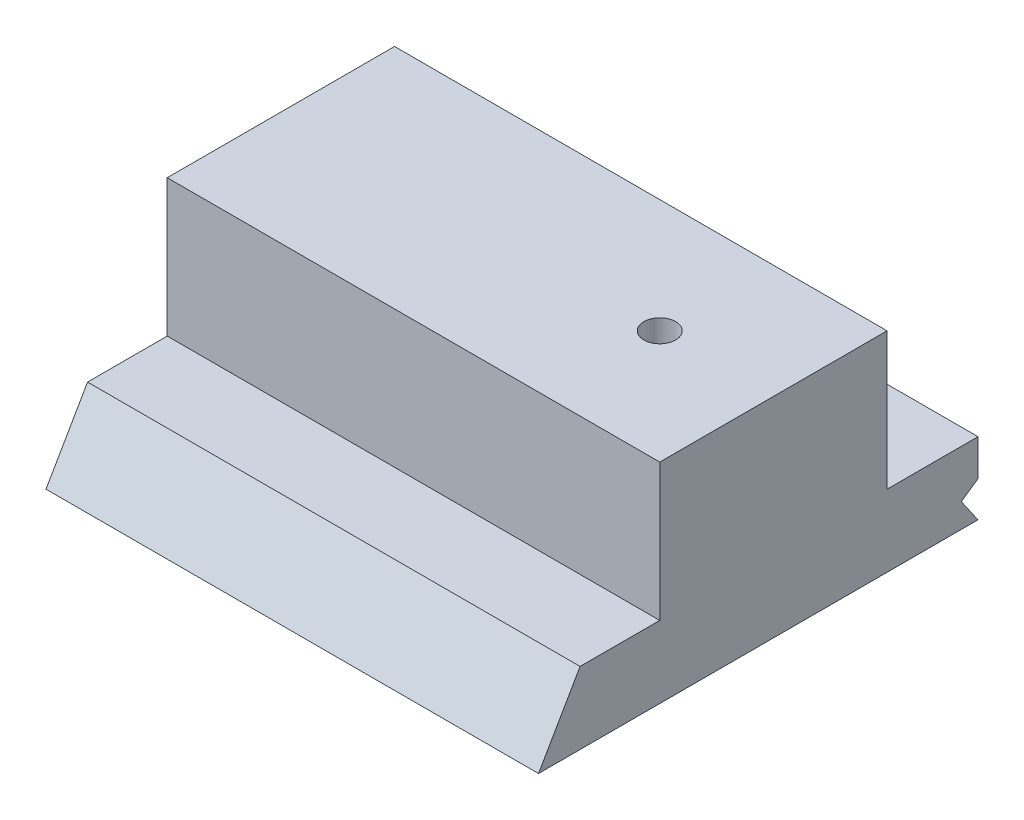
ISO-10303-21;
HEADER;
FILE_DESCRIPTION(('STEP AP214'),'2;1');
FILE_NAME('part.step','',(''),(''),'','','');
FILE_SCHEMA(('AUTOMOTIVE_DESIGN { 1 0 10303 214 1 1 1 1 }'));
ENDSEC;
DATA;
#1=APPLICATION_CONTEXT('core data for automotive mechanical design processes');
#2=APPLICATION_PROTOCOL_DEFINITION('international standard','automotive_design',2000,#1);
#3=PRODUCT_CONTEXT('',#1,'mechanical');
#4=PRODUCT('Part','Part','',(#3));
#5=PRODUCT_RELATED_PRODUCT_CATEGORY('part','',(#4));
#6=PRODUCT_DEFINITION_FORMATION('','',#4);
#7=PRODUCT_DEFINITION_CONTEXT('part definition',#1,'design');
#8=PRODUCT_DEFINITION('design','',#6,#7);
#9=PRODUCT_DEFINITION_SHAPE('','',#8);
#10=(LENGTH_UNIT() NAMED_UNIT(*) SI_UNIT(.MILLI.,.METRE.));
#11=(NAMED_UNIT(*) PLANE_ANGLE_UNIT() SI_UNIT($,.RADIAN.));
#12=(NAMED_UNIT(*) SI_UNIT($,.STERADIAN.) SOLID_ANGLE_UNIT());
#13=UNCERTAINTY_MEASURE_WITH_UNIT(LENGTH_MEASURE(1.E-05),#10,'distance_accuracy_value','');
#14=(GEOMETRIC_REPRESENTATION_CONTEXT(3) GLOBAL_UNCERTAINTY_ASSIGNED_CONTEXT((#13)) GLOBAL_UNIT_ASSIGNED_CONTEXT((#10,
#11,#12)) REPRESENTATION_CONTEXT('',''));
#15=CARTESIAN_POINT('',(0.,0.,0.));
#16=DIRECTION('',(0.,0.,1.));
#17=DIRECTION('',(1.,0.,0.));
#18=AXIS2_PLACEMENT_3D('',#15,#16,#17);
#19=CARTESIAN_POINT('',(50.,0.,-31.));
#20=DIRECTION('',(0.,1.,0.));
#21=DIRECTION('',(0.,0.,1.));
#22=AXIS2_PLACEMENT_3D('',#19,#20,#21);
#23=CYLINDRICAL_SURFACE('',#22,2.1);
#24=CARTESIAN_POINT('',(50.,27.6,-31.));
#25=DIRECTION('',(0.,1.,0.));
#26=DIRECTION('',(0.,0.,1.));
#27=AXIS2_PLACEMENT_3D('',#24,#25,#26);
#28=CIRCLE('',#27,2.1);
#29=CARTESIAN_POINT('',(50.,27.6,-28.9));
#30=VERTEX_POINT('',#29);
#31=EDGE_CURVE('E140',#30,#30,#28,.T.);
#32=ORIENTED_EDGE('',*,*,#31,.T.);
#33=EDGE_LOOP('',(#32));
#34=FACE_BOUND('',#33,.T.);
#35=CARTESIAN_POINT('',(50.,20.,-31.));
#36=DIRECTION('',(0.,-1.,0.));
#37=DIRECTION('',(0.,0.,-1.));
#38=AXIS2_PLACEMENT_3D('',#35,#36,#37);
#39=CIRCLE('',#38,2.1);
#40=CARTESIAN_POINT('',(50.,20.,-33.1));
#41=VERTEX_POINT('',#40);
#42=EDGE_CURVE('E40',#41,#41,#39,.F.);
#43=ORIENTED_EDGE('',*,*,#42,.F.);
#44=EDGE_LOOP('',(#43));
#45=FACE_BOUND('',#44,.T.);
#46=ADVANCED_FACE('F36',(#34,#45),#23,.F.);
#47=CARTESIAN_POINT('',(0.,9.5,-58.));
#48=DIRECTION('',(0.,-1.,0.));
#49=DIRECTION('',(0.,0.,-1.));
#50=AXIS2_PLACEMENT_3D('',#47,#48,#49);
#51=PLANE('',#50);
#52=DIRECTION('',(-1.,0.,0.));
#53=VECTOR('',#52,1.);
#54=CARTESIAN_POINT('',(100.037265875065,9.5,-46.));
#55=LINE('',#54,#53);
#56=CARTESIAN_POINT('',(65.,9.5,-46.));
#57=VERTEX_POINT('',#56);
#58=CARTESIAN_POINT('',(0.,9.5,-46.));
#59=VERTEX_POINT('',#58);
#60=EDGE_CURVE('E53',#57,#59,#55,.T.);
#61=ORIENTED_EDGE('',*,*,#60,.F.);
#62=DIRECTION('',(0.,0.,-1.));
#63=VECTOR('',#62,1.);
#64=CARTESIAN_POINT('',(65.,9.5,0.));
#65=LINE('',#64,#63);
#66=CARTESIAN_POINT('',(65.,9.5,-58.));
#67=VERTEX_POINT('',#66);
#68=EDGE_CURVE('E122',#57,#67,#65,.T.);
#69=ORIENTED_EDGE('',*,*,#68,.T.);
#70=DIRECTION('',(-1.,0.,0.));
#71=VECTOR('',#70,1.);
#72=CARTESIAN_POINT('',(0.,9.5,-58.));
#73=LINE('',#72,#71);
#74=CARTESIAN_POINT('',(0.,9.5,-58.));
#75=VERTEX_POINT('',#74);
#76=EDGE_CURVE('E117',#67,#75,#73,.T.);
#77=ORIENTED_EDGE('',*,*,#76,.T.);
#78=DIRECTION('',(0.,0.,1.));
#79=VECTOR('',#78,1.);
#80=CARTESIAN_POINT('',(0.,9.5,0.));
#81=LINE('',#80,#79);
#82=EDGE_CURVE('E114',#75,#59,#81,.T.);
#83=ORIENTED_EDGE('',*,*,#82,.T.);
#84=EDGE_LOOP('',(#61,#69,#77,#83));
#85=FACE_BOUND('',#84,.T.);
#86=ADVANCED_FACE('F115',(#85),#51,.F.);
#87=CARTESIAN_POINT('',(0.,9.5,0.));
#88=DIRECTION('',(1.,0.,0.));
#89=DIRECTION('',(0.,0.,-1.));
#90=AXIS2_PLACEMENT_3D('',#87,#88,#89);
#91=PLANE('',#90);
#92=DIRECTION('',(0.,-0.56940887936098,0.822054455680931));
#93=VECTOR('',#92,1.);
#94=CARTESIAN_POINT('',(0.,3.17613558209291,-55.8));
#95=LINE('',#94,#93);
#96=CARTESIAN_POINT('',(0.,4.7,-58.));
#97=VERTEX_POINT('',#96);
#98=CARTESIAN_POINT('',(0.,3.17613558209291,-55.8));
#99=VERTEX_POINT('',#98);
#100=EDGE_CURVE('E170',#97,#99,#95,.T.);
#101=ORIENTED_EDGE('',*,*,#100,.T.);
#102=DIRECTION('',(0.,-0.822054455680934,-0.569408879360977));
#103=VECTOR('',#102,1.);
#104=CARTESIAN_POINT('',(0.,0.,-58.));
#105=LINE('',#104,#103);
#106=CARTESIAN_POINT('',(0.,0.,-58.));
#107=VERTEX_POINT('',#106);
#108=EDGE_CURVE('E167',#99,#107,#105,.T.);
#109=ORIENTED_EDGE('',*,*,#108,.T.);
#110=DIRECTION('',(0.,0.,1.));
#111=VECTOR('',#110,1.);
#112=CARTESIAN_POINT('',(0.,0.,0.));
#113=LINE('',#112,#111);
#114=CARTESIAN_POINT('',(0.,0.,0.));
#115=VERTEX_POINT('',#114);
#116=EDGE_CURVE('E187',#107,#115,#113,.T.);
#117=ORIENTED_EDGE('',*,*,#116,.T.);
#118=DIRECTION('',(0.,0.86602540378444,-0.499999999999998));
#119=VECTOR('',#118,1.);
#120=CARTESIAN_POINT('',(0.,0.,0.));
#121=LINE('',#120,#119);
#122=CARTESIAN_POINT('',(0.,9.5,-5.48482755730141));
#123=VERTEX_POINT('',#122);
#124=EDGE_CURVE('E181',#115,#123,#121,.T.);
#125=ORIENTED_EDGE('',*,*,#124,.T.);
#126=CARTESIAN_POINT('',(0.,9.5,-16.));
#127=VERTEX_POINT('',#126);
#128=EDGE_CURVE('E123',#127,#123,#81,.T.);
#129=ORIENTED_EDGE('',*,*,#128,.F.);
#130=DIRECTION('',(0.,1.,0.));
#131=VECTOR('',#130,1.);
#132=CARTESIAN_POINT('',(0.,9.5,-16.));
#133=LINE('',#132,#131);
#134=CARTESIAN_POINT('',(0.,27.6,-16.));
#135=VERTEX_POINT('',#134);
#136=EDGE_CURVE('E139',#127,#135,#133,.T.);
#137=ORIENTED_EDGE('',*,*,#136,.T.);
#138=DIRECTION('',(0.,0.,-1.));
#139=VECTOR('',#138,1.);
#140=CARTESIAN_POINT('',(0.,27.6,-46.));
#141=LINE('',#140,#139);
#142=CARTESIAN_POINT('',(0.,27.6,-46.));
#143=VERTEX_POINT('',#142);
#144=EDGE_CURVE('E134',#135,#143,#141,.T.);
#145=ORIENTED_EDGE('',*,*,#144,.T.);
#146=DIRECTION('',(0.,-1.,0.));
#147=VECTOR('',#146,1.);
#148=CARTESIAN_POINT('',(0.,9.5,-46.));
#149=LINE('',#148,#147);
#150=EDGE_CURVE('E130',#143,#59,#149,.T.);
#151=ORIENTED_EDGE('',*,*,#150,.T.);
#152=ORIENTED_EDGE('',*,*,#82,.F.);
#153=DIRECTION('',(0.,-1.,0.));
#154=VECTOR('',#153,1.);
#155=CARTESIAN_POINT('',(0.,9.5,-58.));
#156=LINE('',#155,#154);
#157=EDGE_CURVE('E45',#75,#97,#156,.T.);
#158=ORIENTED_EDGE('',*,*,#157,.T.);
#159=EDGE_LOOP('',(#101,#109,#117,#125,#129,#137,#145,#151,#152,#158));
#160=FACE_BOUND('',#159,.T.);
#161=ADVANCED_FACE('F38',(#160),#91,.F.);
#162=CARTESIAN_POINT('',(65.,9.5,0.));
#163=DIRECTION('',(-1.,0.,0.));
#164=DIRECTION('',(0.,0.,1.));
#165=AXIS2_PLACEMENT_3D('',#162,#163,#164);
#166=PLANE('',#165);
#167=DIRECTION('',(0.,0.,-1.));
#168=VECTOR('',#167,1.);
#169=CARTESIAN_POINT('',(65.,0.,0.));
#170=LINE('',#169,#168);
#171=CARTESIAN_POINT('',(65.,0.,0.));
#172=VERTEX_POINT('',#171);
#173=CARTESIAN_POINT('',(65.,0.,-58.));
#174=VERTEX_POINT('',#173);
#175=EDGE_CURVE('E199',#172,#174,#170,.T.);
#176=ORIENTED_EDGE('',*,*,#175,.T.);
#177=DIRECTION('',(0.,-0.822054455680934,-0.569408879360977));
#178=VECTOR('',#177,1.);
#179=CARTESIAN_POINT('',(65.,0.,-58.));
#180=LINE('',#179,#178);
#181=CARTESIAN_POINT('',(65.,3.17613558209291,-55.8));
#182=VERTEX_POINT('',#181);
#183=EDGE_CURVE('E151',#182,#174,#180,.T.);
#184=ORIENTED_EDGE('',*,*,#183,.F.);
#185=DIRECTION('',(0.,-0.56940887936098,0.822054455680931));
#186=VECTOR('',#185,1.);
#187=CARTESIAN_POINT('',(65.,3.17613558209291,-55.8));
#188=LINE('',#187,#186);
#189=CARTESIAN_POINT('',(65.,4.7,-58.));
#190=VERTEX_POINT('',#189);
#191=EDGE_CURVE('E171',#190,#182,#188,.T.);
#192=ORIENTED_EDGE('',*,*,#191,.F.);
#193=DIRECTION('',(0.,-1.,0.));
#194=VECTOR('',#193,1.);
#195=CARTESIAN_POINT('',(65.,9.5,-58.));
#196=LINE('',#195,#194);
#197=EDGE_CURVE('E11',#67,#190,#196,.T.);
#198=ORIENTED_EDGE('',*,*,#197,.F.);
#199=ORIENTED_EDGE('',*,*,#68,.F.);
#200=DIRECTION('',(0.,1.,0.));
#201=VECTOR('',#200,1.);
#202=CARTESIAN_POINT('',(65.,9.5,-46.));
#203=LINE('',#202,#201);
#204=CARTESIAN_POINT('',(65.,27.6,-46.));
#205=VERTEX_POINT('',#204);
#206=EDGE_CURVE('E132',#57,#205,#203,.T.);
#207=ORIENTED_EDGE('',*,*,#206,.T.);
#208=DIRECTION('',(0.,0.,1.));
#209=VECTOR('',#208,1.);
#210=CARTESIAN_POINT('',(65.,27.6,-46.));
#211=LINE('',#210,#209);
#212=CARTESIAN_POINT('',(65.,27.6,-16.));
#213=VERTEX_POINT('',#212);
#214=EDGE_CURVE('E152',#205,#213,#211,.T.);
#215=ORIENTED_EDGE('',*,*,#214,.T.);
#216=DIRECTION('',(0.,-1.,0.));
#217=VECTOR('',#216,1.);
#218=CARTESIAN_POINT('',(65.,9.5,-16.));
#219=LINE('',#218,#217);
#220=CARTESIAN_POINT('',(65.,9.5,-16.));
#221=VERTEX_POINT('',#220);
#222=EDGE_CURVE('E155',#213,#221,#219,.T.);
#223=ORIENTED_EDGE('',*,*,#222,.T.);
#224=CARTESIAN_POINT('',(65.,9.5,-5.48482755730141));
#225=VERTEX_POINT('',#224);
#226=EDGE_CURVE('E61',#225,#221,#65,.T.);
#227=ORIENTED_EDGE('',*,*,#226,.F.);
#228=DIRECTION('',(0.,0.86602540378444,-0.499999999999998));
#229=VECTOR('',#228,1.);
#230=CARTESIAN_POINT('',(65.,0.,0.));
#231=LINE('',#230,#229);
#232=EDGE_CURVE('E179',#172,#225,#231,.T.);
#233=ORIENTED_EDGE('',*,*,#232,.F.);
#234=EDGE_LOOP('',(#176,#184,#192,#198,#199,#207,#215,#223,#227,#233));
#235=FACE_BOUND('',#234,.T.);
#236=ADVANCED_FACE('F208',(#235),#166,.F.);
#237=CARTESIAN_POINT('',(0.,9.5,-58.));
#238=DIRECTION('',(0.,0.,1.));
#239=DIRECTION('',(1.,0.,0.));
#240=AXIS2_PLACEMENT_3D('',#237,#238,#239);
#241=PLANE('',#240);
#242=ORIENTED_EDGE('',*,*,#197,.T.);
#243=DIRECTION('',(1.,0.,0.));
#244=VECTOR('',#243,1.);
#245=CARTESIAN_POINT('',(0.,4.7,-58.));
#246=LINE('',#245,#244);
#247=EDGE_CURVE('E173',#97,#190,#246,.T.);
#248=ORIENTED_EDGE('',*,*,#247,.F.);
#249=ORIENTED_EDGE('',*,*,#157,.F.);
#250=ORIENTED_EDGE('',*,*,#76,.F.);
#251=EDGE_LOOP('',(#242,#248,#249,#250));
#252=FACE_BOUND('',#251,.T.);
#253=ADVANCED_FACE('F212',(#252),#241,.F.);
#254=ORIENTED_EDGE('',*,*,#226,.T.);
#255=DIRECTION('',(-1.,0.,0.));
#256=VECTOR('',#255,1.);
#257=CARTESIAN_POINT('',(100.037265875065,9.5,-16.));
#258=LINE('',#257,#256);
#259=EDGE_CURVE('E133',#221,#127,#258,.T.);
#260=ORIENTED_EDGE('',*,*,#259,.T.);
#261=ORIENTED_EDGE('',*,*,#128,.T.);
#262=DIRECTION('',(1.,0.,0.));
#263=VECTOR('',#262,1.);
#264=CARTESIAN_POINT('',(0.,9.5,-5.48482755730141));
#265=LINE('',#264,#263);
#266=EDGE_CURVE('E184',#123,#225,#265,.T.);
#267=ORIENTED_EDGE('',*,*,#266,.T.);
#268=EDGE_LOOP('',(#254,#260,#261,#267));
#269=FACE_BOUND('',#268,.T.);
#270=ADVANCED_FACE('F230',(#269),#51,.F.);
#271=CARTESIAN_POINT('',(0.,0.,-58.));
#272=DIRECTION('',(0.,-1.,0.));
#273=DIRECTION('',(0.,0.,-1.));
#274=AXIS2_PLACEMENT_3D('',#271,#272,#273);
#275=PLANE('',#274);
#276=CARTESIAN_POINT('',(50.,0.,-31.));
#277=DIRECTION('',(0.,-1.,0.));
#278=DIRECTION('',(0.,0.,-1.));
#279=AXIS2_PLACEMENT_3D('',#276,#277,#278);
#280=CIRCLE('',#279,4.00000000000001);
#281=CARTESIAN_POINT('',(50.,0.,-35.));
#282=VERTEX_POINT('',#281);
#283=EDGE_CURVE('E242',#282,#282,#280,.T.);
#284=ORIENTED_EDGE('',*,*,#283,.F.);
#285=EDGE_LOOP('',(#284));
#286=FACE_BOUND('',#285,.T.);
#287=ORIENTED_EDGE('',*,*,#116,.F.);
#288=DIRECTION('',(-1.,0.,0.));
#289=VECTOR('',#288,1.);
#290=CARTESIAN_POINT('',(0.,0.,-58.));
#291=LINE('',#290,#289);
#292=EDGE_CURVE('E197',#174,#107,#291,.T.);
#293=ORIENTED_EDGE('',*,*,#292,.F.);
#294=ORIENTED_EDGE('',*,*,#175,.F.);
#295=DIRECTION('',(1.,0.,0.));
#296=VECTOR('',#295,1.);
#297=CARTESIAN_POINT('',(0.,0.,0.));
#298=LINE('',#297,#296);
#299=EDGE_CURVE('E202',#115,#172,#298,.T.);
#300=ORIENTED_EDGE('',*,*,#299,.F.);
#301=EDGE_LOOP('',(#287,#293,#294,#300));
#302=FACE_BOUND('',#301,.T.);
#303=ADVANCED_FACE('F222',(#286,#302),#275,.T.);
#304=CARTESIAN_POINT('',(0.,0.,0.));
#305=DIRECTION('',(0.,-0.499999999999998,-0.86602540378444));
#306=DIRECTION('',(0.,0.86602540378444,-0.499999999999998));
#307=AXIS2_PLACEMENT_3D('',#304,#305,#306);
#308=PLANE('',#307);
#309=ORIENTED_EDGE('',*,*,#232,.T.);
#310=ORIENTED_EDGE('',*,*,#266,.F.);
#311=ORIENTED_EDGE('',*,*,#124,.F.);
#312=ORIENTED_EDGE('',*,*,#299,.T.);
#313=EDGE_LOOP('',(#309,#310,#311,#312));
#314=FACE_BOUND('',#313,.T.);
#315=ADVANCED_FACE('F228',(#314),#308,.F.);
#316=CARTESIAN_POINT('',(0.,0.,-58.));
#317=DIRECTION('',(0.,-0.569408879360977,0.822054455680933));
#318=DIRECTION('',(0.,-0.822054455680934,-0.569408879360977));
#319=AXIS2_PLACEMENT_3D('',#316,#317,#318);
#320=PLANE('',#319);
#321=ORIENTED_EDGE('',*,*,#183,.T.);
#322=ORIENTED_EDGE('',*,*,#292,.T.);
#323=ORIENTED_EDGE('',*,*,#108,.F.);
#324=DIRECTION('',(1.,0.,0.));
#325=VECTOR('',#324,1.);
#326=CARTESIAN_POINT('',(0.,3.17613558209291,-55.8));
#327=LINE('',#326,#325);
#328=EDGE_CURVE('E177',#99,#182,#327,.T.);
#329=ORIENTED_EDGE('',*,*,#328,.T.);
#330=EDGE_LOOP('',(#321,#322,#323,#329));
#331=FACE_BOUND('',#330,.T.);
#332=ADVANCED_FACE('F218',(#331),#320,.F.);
#333=CARTESIAN_POINT('',(0.,3.17613558209291,-55.8));
#334=DIRECTION('',(0.,0.822054455680931,0.56940887936098));
#335=DIRECTION('',(0.,-0.56940887936098,0.822054455680931));
#336=AXIS2_PLACEMENT_3D('',#333,#334,#335);
#337=PLANE('',#336);
#338=ORIENTED_EDGE('',*,*,#191,.T.);
#339=ORIENTED_EDGE('',*,*,#328,.F.);
#340=ORIENTED_EDGE('',*,*,#100,.F.);
#341=ORIENTED_EDGE('',*,*,#247,.T.);
#342=EDGE_LOOP('',(#338,#339,#340,#341));
#343=FACE_BOUND('',#342,.T.);
#344=ADVANCED_FACE('F216',(#343),#337,.F.);
#345=CARTESIAN_POINT('',(100.037265875065,9.5,-46.));
#346=DIRECTION('',(0.,0.,-1.));
#347=DIRECTION('',(-1.,0.,0.));
#348=AXIS2_PLACEMENT_3D('',#345,#346,#347);
#349=PLANE('',#348);
#350=ORIENTED_EDGE('',*,*,#206,.F.);
#351=ORIENTED_EDGE('',*,*,#60,.T.);
#352=ORIENTED_EDGE('',*,*,#150,.F.);
#353=DIRECTION('',(-1.,0.,0.));
#354=VECTOR('',#353,1.);
#355=CARTESIAN_POINT('',(100.037265875065,27.6,-46.));
#356=LINE('',#355,#354);
#357=EDGE_CURVE('E157',#205,#143,#356,.T.);
#358=ORIENTED_EDGE('',*,*,#357,.F.);
#359=EDGE_LOOP('',(#350,#351,#352,#358));
#360=FACE_BOUND('',#359,.T.);
#361=ADVANCED_FACE('F128',(#360),#349,.T.);
#362=CARTESIAN_POINT('',(100.037265875065,27.6,-46.));
#363=DIRECTION('',(0.,1.,0.));
#364=DIRECTION('',(0.,0.,1.));
#365=AXIS2_PLACEMENT_3D('',#362,#363,#364);
#366=PLANE('',#365);
#367=ORIENTED_EDGE('',*,*,#31,.F.);
#368=EDGE_LOOP('',(#367));
#369=FACE_BOUND('',#368,.T.);
#370=ORIENTED_EDGE('',*,*,#214,.F.);
#371=ORIENTED_EDGE('',*,*,#357,.T.);
#372=ORIENTED_EDGE('',*,*,#144,.F.);
#373=DIRECTION('',(-1.,0.,0.));
#374=VECTOR('',#373,1.);
#375=CARTESIAN_POINT('',(100.037265875065,27.6,-16.));
#376=LINE('',#375,#374);
#377=EDGE_CURVE('E161',#213,#135,#376,.T.);
#378=ORIENTED_EDGE('',*,*,#377,.F.);
#379=EDGE_LOOP('',(#370,#371,#372,#378));
#380=FACE_BOUND('',#379,.T.);
#381=ADVANCED_FACE('F238',(#369,#380),#366,.T.);
#382=CARTESIAN_POINT('',(100.037265875065,9.5,-16.));
#383=DIRECTION('',(0.,0.,1.));
#384=DIRECTION('',(1.,0.,0.));
#385=AXIS2_PLACEMENT_3D('',#382,#383,#384);
#386=PLANE('',#385);
#387=ORIENTED_EDGE('',*,*,#222,.F.);
#388=ORIENTED_EDGE('',*,*,#377,.T.);
#389=ORIENTED_EDGE('',*,*,#136,.F.);
#390=ORIENTED_EDGE('',*,*,#259,.F.);
#391=EDGE_LOOP('',(#387,#388,#389,#390));
#392=FACE_BOUND('',#391,.T.);
#393=ADVANCED_FACE('F236',(#392),#386,.T.);
#394=CARTESIAN_POINT('',(50.,20.,-31.));
#395=DIRECTION('',(0.,-1.,0.));
#396=DIRECTION('',(0.,0.,-1.));
#397=AXIS2_PLACEMENT_3D('',#394,#395,#396);
#398=PLANE('',#397);
#399=CARTESIAN_POINT('',(50.,20.,-31.));
#400=DIRECTION('',(0.,-1.,0.));
#401=DIRECTION('',(0.,0.,-1.));
#402=AXIS2_PLACEMENT_3D('',#399,#400,#401);
#403=CIRCLE('',#402,4.00000000000001);
#404=CARTESIAN_POINT('',(50.,20.,-35.));
#405=VERTEX_POINT('',#404);
#406=EDGE_CURVE('E245',#405,#405,#403,.T.);
#407=ORIENTED_EDGE('',*,*,#406,.T.);
#408=EDGE_LOOP('',(#407));
#409=FACE_BOUND('',#408,.T.);
#410=ORIENTED_EDGE('',*,*,#42,.T.);
#411=EDGE_LOOP('',(#410));
#412=FACE_BOUND('',#411,.T.);
#413=ADVANCED_FACE('F252',(#409,#412),#398,.T.);
#414=CARTESIAN_POINT('',(50.,20.,-31.));
#415=DIRECTION('',(0.,-1.,0.));
#416=DIRECTION('',(0.,0.,-1.));
#417=AXIS2_PLACEMENT_3D('',#414,#415,#416);
#418=CYLINDRICAL_SURFACE('',#417,4.00000000000001);
#419=ORIENTED_EDGE('',*,*,#406,.F.);
#420=EDGE_LOOP('',(#419));
#421=FACE_BOUND('',#420,.T.);
#422=ORIENTED_EDGE('',*,*,#283,.T.);
#423=EDGE_LOOP('',(#422));
#424=FACE_BOUND('',#423,.T.);
#425=ADVANCED_FACE('F263',(#421,#424),#418,.F.);
#426=CLOSED_SHELL('',(#46,#86,#161,#236,#253,#270,#303,#315,#332,#344,#361,#381,#393,#413,#425));
#427=MANIFOLD_SOLID_BREP('B2',#426);
#428=ADVANCED_BREP_SHAPE_REPRESENTATION('',(#18,#427),#14);
#429=SHAPE_DEFINITION_REPRESENTATION(#9,#428);
ENDSEC;
END-ISO-10303-21;
